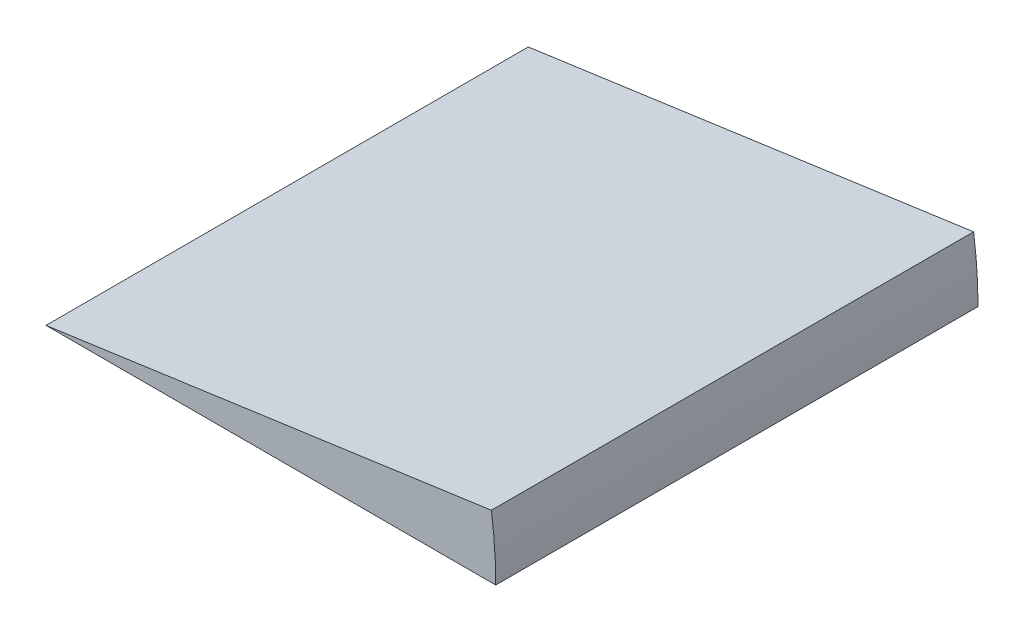
ISO-10303-21;
HEADER;
FILE_DESCRIPTION(('STEP AP214'),'2;1');
FILE_NAME('part.step','',(''),(''),'','','');
FILE_SCHEMA(('AUTOMOTIVE_DESIGN { 1 0 10303 214 1 1 1 1 }'));
ENDSEC;
DATA;
#1=APPLICATION_CONTEXT('core data for automotive mechanical design processes');
#2=APPLICATION_PROTOCOL_DEFINITION('international standard','automotive_design',2000,#1);
#3=PRODUCT_CONTEXT('',#1,'mechanical');
#4=PRODUCT('Part','Part','',(#3));
#5=PRODUCT_RELATED_PRODUCT_CATEGORY('part','',(#4));
#6=PRODUCT_DEFINITION_FORMATION('','',#4);
#7=PRODUCT_DEFINITION_CONTEXT('part definition',#1,'design');
#8=PRODUCT_DEFINITION('design','',#6,#7);
#9=PRODUCT_DEFINITION_SHAPE('','',#8);
#10=(LENGTH_UNIT() NAMED_UNIT(*) SI_UNIT(.MILLI.,.METRE.));
#11=(NAMED_UNIT(*) PLANE_ANGLE_UNIT() SI_UNIT($,.RADIAN.));
#12=(NAMED_UNIT(*) SI_UNIT($,.STERADIAN.) SOLID_ANGLE_UNIT());
#13=UNCERTAINTY_MEASURE_WITH_UNIT(LENGTH_MEASURE(1.E-05),#10,'distance_accuracy_value','');
#14=(GEOMETRIC_REPRESENTATION_CONTEXT(3) GLOBAL_UNCERTAINTY_ASSIGNED_CONTEXT((#13)) GLOBAL_UNIT_ASSIGNED_CONTEXT((#10,
#11,#12)) REPRESENTATION_CONTEXT('',''));
#15=CARTESIAN_POINT('',(0.,0.,0.));
#16=DIRECTION('',(0.,0.,1.));
#17=DIRECTION('',(1.,0.,0.));
#18=AXIS2_PLACEMENT_3D('',#15,#16,#17);
#19=CARTESIAN_POINT('',(-54.483,0.,58.42));
#20=DIRECTION('',(0.,0.,-1.));
#21=DIRECTION('',(-1.,0.,0.));
#22=AXIS2_PLACEMENT_3D('',#19,#20,#21);
#23=CYLINDRICAL_SURFACE('',#22,108.966);
#24=CARTESIAN_POINT('',(-54.483,0.,58.42));
#25=DIRECTION('',(0.,0.,-1.));
#26=DIRECTION('',(-1.,0.,0.));
#27=AXIS2_PLACEMENT_3D('',#24,#25,#26);
#28=CIRCLE('',#27,108.966);
#29=CARTESIAN_POINT('',(53.4225503784939,15.1651361192145,58.42));
#30=VERTEX_POINT('',#29);
#31=CARTESIAN_POINT('',(54.483,0.,58.42));
#32=VERTEX_POINT('',#31);
#33=EDGE_CURVE('E11',#30,#32,#28,.T.);
#34=ORIENTED_EDGE('',*,*,#33,.T.);
#35=DIRECTION('',(0.,0.,-1.));
#36=VECTOR('',#35,1.);
#37=CARTESIAN_POINT('',(54.483,0.,58.42));
#38=LINE('',#37,#36);
#39=CARTESIAN_POINT('',(54.483,0.,-58.42));
#40=VERTEX_POINT('',#39);
#41=EDGE_CURVE('E80',#32,#40,#38,.T.);
#42=ORIENTED_EDGE('',*,*,#41,.T.);
#43=CARTESIAN_POINT('',(-54.483,0.,-58.42));
#44=DIRECTION('',(0.,0.,-1.));
#45=DIRECTION('',(-1.,0.,0.));
#46=AXIS2_PLACEMENT_3D('',#43,#44,#45);
#47=CIRCLE('',#46,108.966);
#48=CARTESIAN_POINT('',(53.4225503784939,15.1651361192145,-58.42));
#49=VERTEX_POINT('',#48);
#50=EDGE_CURVE('E43',#49,#40,#47,.T.);
#51=ORIENTED_EDGE('',*,*,#50,.F.);
#52=DIRECTION('',(0.,0.,-1.));
#53=VECTOR('',#52,1.);
#54=CARTESIAN_POINT('',(53.4225503784939,15.1651361192145,58.42));
#55=LINE('',#54,#53);
#56=EDGE_CURVE('E86',#30,#49,#55,.T.);
#57=ORIENTED_EDGE('',*,*,#56,.F.);
#58=EDGE_LOOP('',(#34,#42,#51,#57));
#59=FACE_BOUND('',#58,.T.);
#60=ADVANCED_FACE('F35',(#59),#23,.T.);
#61=CARTESIAN_POINT('',(-54.483,0.,58.42));
#62=DIRECTION('',(0.,0.,-1.));
#63=DIRECTION('',(-1.,0.,0.));
#64=AXIS2_PLACEMENT_3D('',#61,#62,#63);
#65=PLANE('',#64);
#66=DIRECTION('',(1.,0.,0.));
#67=VECTOR('',#66,1.);
#68=CARTESIAN_POINT('',(-54.483,0.,58.42));
#69=LINE('',#68,#67);
#70=CARTESIAN_POINT('',(-54.483,0.,58.42));
#71=VERTEX_POINT('',#70);
#72=EDGE_CURVE('E55',#71,#32,#69,.T.);
#73=ORIENTED_EDGE('',*,*,#72,.T.);
#74=ORIENTED_EDGE('',*,*,#33,.F.);
#75=DIRECTION('',(0.99026806874157,0.139173100960066,0.));
#76=VECTOR('',#75,1.);
#77=CARTESIAN_POINT('',(-54.483,0.,58.42));
#78=LINE('',#77,#76);
#79=EDGE_CURVE('E78',#71,#30,#78,.T.);
#80=ORIENTED_EDGE('',*,*,#79,.F.);
#81=EDGE_LOOP('',(#73,#74,#80));
#82=FACE_BOUND('',#81,.T.);
#83=ADVANCED_FACE('F37',(#82),#65,.F.);
#84=CARTESIAN_POINT('',(-54.483,0.,-58.42));
#85=DIRECTION('',(0.,0.,1.));
#86=DIRECTION('',(1.,0.,0.));
#87=AXIS2_PLACEMENT_3D('',#84,#85,#86);
#88=PLANE('',#87);
#89=DIRECTION('',(-0.99026806874157,-0.139173100960066,0.));
#90=VECTOR('',#89,1.);
#91=CARTESIAN_POINT('',(-54.483,0.,-58.42));
#92=LINE('',#91,#90);
#93=CARTESIAN_POINT('',(-54.483,0.,-58.42));
#94=VERTEX_POINT('',#93);
#95=EDGE_CURVE('E73',#49,#94,#92,.T.);
#96=ORIENTED_EDGE('',*,*,#95,.F.);
#97=ORIENTED_EDGE('',*,*,#50,.T.);
#98=DIRECTION('',(-1.,0.,0.));
#99=VECTOR('',#98,1.);
#100=CARTESIAN_POINT('',(-54.483,0.,-58.42));
#101=LINE('',#100,#99);
#102=EDGE_CURVE('E71',#40,#94,#101,.T.);
#103=ORIENTED_EDGE('',*,*,#102,.T.);
#104=EDGE_LOOP('',(#96,#97,#103));
#105=FACE_BOUND('',#104,.T.);
#106=ADVANCED_FACE('F70',(#105),#88,.F.);
#107=CARTESIAN_POINT('',(53.4225503784939,15.1651361192145,-58.42));
#108=DIRECTION('',(0.139173100960066,-0.99026806874157,0.));
#109=DIRECTION('',(0.,0.,-1.));
#110=AXIS2_PLACEMENT_3D('',#107,#108,#109);
#111=PLANE('',#110);
#112=ORIENTED_EDGE('',*,*,#56,.T.);
#113=ORIENTED_EDGE('',*,*,#95,.T.);
#114=DIRECTION('',(0.,0.,1.));
#115=VECTOR('',#114,1.);
#116=CARTESIAN_POINT('',(-54.483,0.,58.42));
#117=LINE('',#116,#115);
#118=EDGE_CURVE('E81',#94,#71,#117,.T.);
#119=ORIENTED_EDGE('',*,*,#118,.T.);
#120=ORIENTED_EDGE('',*,*,#79,.T.);
#121=EDGE_LOOP('',(#112,#113,#119,#120));
#122=FACE_BOUND('',#121,.T.);
#123=ADVANCED_FACE('F91',(#122),#111,.F.);
#124=CARTESIAN_POINT('',(54.483,0.,-58.42));
#125=DIRECTION('',(0.,-1.,0.));
#126=DIRECTION('',(0.,0.,-1.));
#127=AXIS2_PLACEMENT_3D('',#124,#125,#126);
#128=PLANE('',#127);
#129=ORIENTED_EDGE('',*,*,#41,.F.);
#130=ORIENTED_EDGE('',*,*,#72,.F.);
#131=ORIENTED_EDGE('',*,*,#118,.F.);
#132=ORIENTED_EDGE('',*,*,#102,.F.);
#133=EDGE_LOOP('',(#129,#130,#131,#132));
#134=FACE_BOUND('',#133,.T.);
#135=ADVANCED_FACE('F79',(#134),#128,.T.);
#136=CLOSED_SHELL('',(#60,#83,#106,#123,#135));
#137=MANIFOLD_SOLID_BREP('B2',#136);
#138=ADVANCED_BREP_SHAPE_REPRESENTATION('',(#18,#137),#14);
#139=SHAPE_DEFINITION_REPRESENTATION(#9,#138);
ENDSEC;
END-ISO-10303-21;
